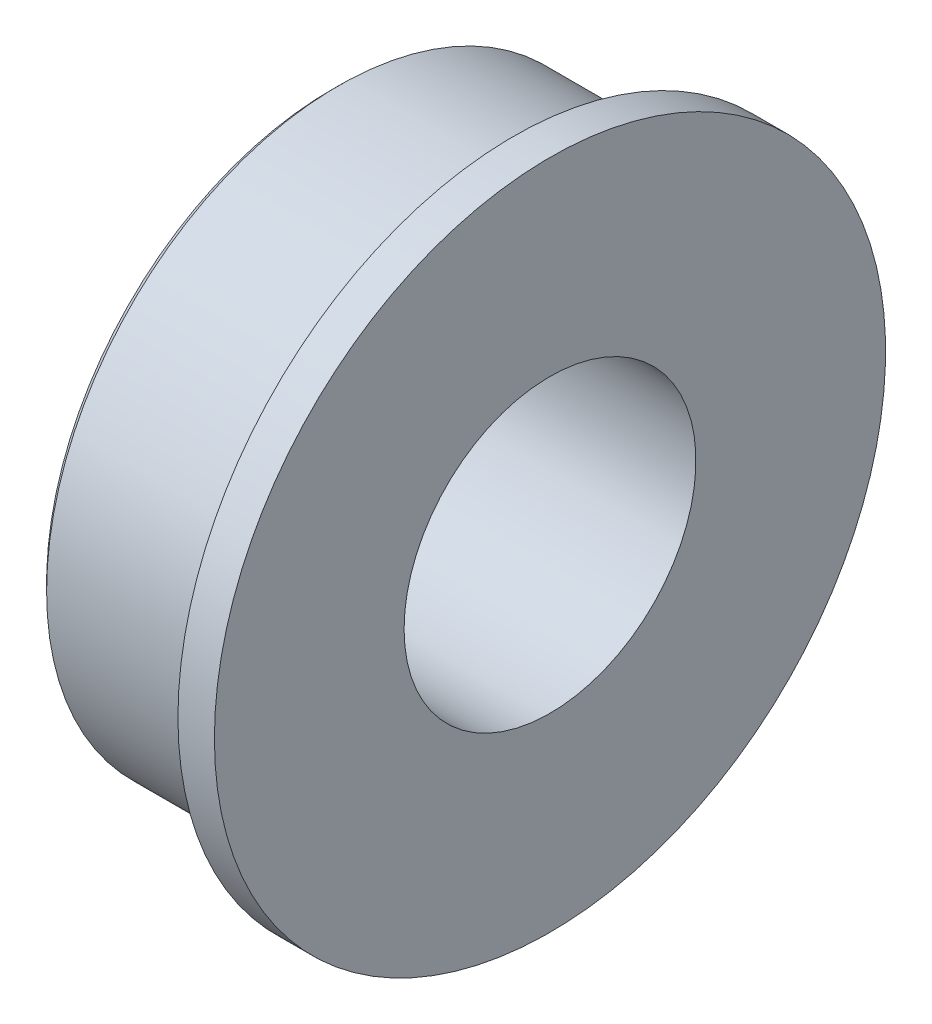
ISO-10303-21;
HEADER;
FILE_DESCRIPTION(('STEP AP214'),'2;1');
FILE_NAME('part.step','',(''),(''),'','','');
FILE_SCHEMA(('AUTOMOTIVE_DESIGN { 1 0 10303 214 1 1 1 1 }'));
ENDSEC;
DATA;
#1=APPLICATION_CONTEXT('core data for automotive mechanical design processes');
#2=APPLICATION_PROTOCOL_DEFINITION('international standard','automotive_design',2000,#1);
#3=PRODUCT_CONTEXT('',#1,'mechanical');
#4=PRODUCT('Part','Part','',(#3));
#5=PRODUCT_RELATED_PRODUCT_CATEGORY('part','',(#4));
#6=PRODUCT_DEFINITION_FORMATION('','',#4);
#7=PRODUCT_DEFINITION_CONTEXT('part definition',#1,'design');
#8=PRODUCT_DEFINITION('design','',#6,#7);
#9=PRODUCT_DEFINITION_SHAPE('','',#8);
#10=(LENGTH_UNIT() NAMED_UNIT(*) SI_UNIT(.MILLI.,.METRE.));
#11=(NAMED_UNIT(*) PLANE_ANGLE_UNIT() SI_UNIT($,.RADIAN.));
#12=(NAMED_UNIT(*) SI_UNIT($,.STERADIAN.) SOLID_ANGLE_UNIT());
#13=UNCERTAINTY_MEASURE_WITH_UNIT(LENGTH_MEASURE(1.E-05),#10,'distance_accuracy_value','');
#14=(GEOMETRIC_REPRESENTATION_CONTEXT(3) GLOBAL_UNCERTAINTY_ASSIGNED_CONTEXT((#13)) GLOBAL_UNIT_ASSIGNED_CONTEXT((#10,
#11,#12)) REPRESENTATION_CONTEXT('',''));
#15=CARTESIAN_POINT('',(0.,0.,0.));
#16=DIRECTION('',(0.,0.,1.));
#17=DIRECTION('',(1.,0.,0.));
#18=AXIS2_PLACEMENT_3D('',#15,#16,#17);
#19=CARTESIAN_POINT('',(0.,0.,0.));
#20=DIRECTION('',(-1.,0.,0.));
#21=DIRECTION('',(0.,0.,1.));
#22=AXIS2_PLACEMENT_3D('',#19,#20,#21);
#23=CYLINDRICAL_SURFACE('',#22,2.);
#24=CARTESIAN_POINT('',(3.,0.,0.));
#25=DIRECTION('',(-1.,0.,0.));
#26=DIRECTION('',(0.,0.,1.));
#27=AXIS2_PLACEMENT_3D('',#24,#25,#26);
#28=CIRCLE('',#27,2.);
#29=CARTESIAN_POINT('',(3.,0.,2.));
#30=VERTEX_POINT('',#29);
#31=EDGE_CURVE('E62',#30,#30,#28,.T.);
#32=ORIENTED_EDGE('',*,*,#31,.F.);
#33=EDGE_LOOP('',(#32));
#34=FACE_BOUND('',#33,.T.);
#35=CARTESIAN_POINT('',(0.,0.,0.));
#36=DIRECTION('',(-1.,0.,0.));
#37=DIRECTION('',(0.,0.,1.));
#38=AXIS2_PLACEMENT_3D('',#35,#36,#37);
#39=CIRCLE('',#38,2.);
#40=CARTESIAN_POINT('',(0.,0.,2.));
#41=VERTEX_POINT('',#40);
#42=EDGE_CURVE('E47',#41,#41,#39,.T.);
#43=ORIENTED_EDGE('',*,*,#42,.T.);
#44=EDGE_LOOP('',(#43));
#45=FACE_BOUND('',#44,.T.);
#46=ADVANCED_FACE('F35',(#34,#45),#23,.F.);
#47=CARTESIAN_POINT('',(0.,2.,0.));
#48=DIRECTION('',(1.,0.,0.));
#49=DIRECTION('',(0.,0.,-1.));
#50=AXIS2_PLACEMENT_3D('',#47,#48,#49);
#51=PLANE('',#50);
#52=CARTESIAN_POINT('',(0.,0.,0.));
#53=DIRECTION('',(1.,0.,0.));
#54=DIRECTION('',(0.,0.,-1.));
#55=AXIS2_PLACEMENT_3D('',#52,#53,#54);
#56=CIRCLE('',#55,3.9);
#57=CARTESIAN_POINT('',(0.,0.,-3.9));
#58=VERTEX_POINT('',#57);
#59=EDGE_CURVE('E43',#58,#58,#56,.F.);
#60=ORIENTED_EDGE('',*,*,#59,.T.);
#61=EDGE_LOOP('',(#60));
#62=FACE_BOUND('',#61,.T.);
#63=ORIENTED_EDGE('',*,*,#42,.F.);
#64=EDGE_LOOP('',(#63));
#65=FACE_BOUND('',#64,.T.);
#66=ADVANCED_FACE('F70',(#62,#65),#51,.F.);
#67=CARTESIAN_POINT('',(0.,0.,0.));
#68=DIRECTION('',(-1.,0.,0.));
#69=DIRECTION('',(0.,0.,1.));
#70=AXIS2_PLACEMENT_3D('',#67,#68,#69);
#71=CYLINDRICAL_SURFACE('',#70,4.);
#72=CARTESIAN_POINT('',(0.0999999999999977,0.,0.));
#73=DIRECTION('',(1.,0.,0.));
#74=DIRECTION('',(0.,0.,-1.));
#75=AXIS2_PLACEMENT_3D('',#72,#73,#74);
#76=CIRCLE('',#75,4.);
#77=CARTESIAN_POINT('',(0.0999999999999977,0.,-4.));
#78=VERTEX_POINT('',#77);
#79=EDGE_CURVE('E10',#78,#78,#76,.T.);
#80=ORIENTED_EDGE('',*,*,#79,.T.);
#81=EDGE_LOOP('',(#80));
#82=FACE_BOUND('',#81,.T.);
#83=CARTESIAN_POINT('',(2.5,0.,0.));
#84=DIRECTION('',(-1.,0.,0.));
#85=DIRECTION('',(0.,0.,1.));
#86=AXIS2_PLACEMENT_3D('',#83,#84,#85);
#87=CIRCLE('',#86,4.);
#88=CARTESIAN_POINT('',(2.5,0.,4.));
#89=VERTEX_POINT('',#88);
#90=EDGE_CURVE('E51',#89,#89,#87,.T.);
#91=ORIENTED_EDGE('',*,*,#90,.T.);
#92=EDGE_LOOP('',(#91));
#93=FACE_BOUND('',#92,.T.);
#94=ADVANCED_FACE('F74',(#82,#93),#71,.T.);
#95=CARTESIAN_POINT('',(2.5,4.,0.));
#96=DIRECTION('',(1.,0.,0.));
#97=DIRECTION('',(0.,0.,-1.));
#98=AXIS2_PLACEMENT_3D('',#95,#96,#97);
#99=PLANE('',#98);
#100=ORIENTED_EDGE('',*,*,#90,.F.);
#101=EDGE_LOOP('',(#100));
#102=FACE_BOUND('',#101,.T.);
#103=CARTESIAN_POINT('',(2.5,0.,0.));
#104=DIRECTION('',(-1.,0.,0.));
#105=DIRECTION('',(0.,0.,1.));
#106=AXIS2_PLACEMENT_3D('',#103,#104,#105);
#107=CIRCLE('',#106,4.6);
#108=CARTESIAN_POINT('',(2.5,0.,4.6));
#109=VERTEX_POINT('',#108);
#110=EDGE_CURVE('E56',#109,#109,#107,.T.);
#111=ORIENTED_EDGE('',*,*,#110,.T.);
#112=EDGE_LOOP('',(#111));
#113=FACE_BOUND('',#112,.T.);
#114=ADVANCED_FACE('F79',(#102,#113),#99,.F.);
#115=CARTESIAN_POINT('',(0.,0.,0.));
#116=DIRECTION('',(-1.,0.,0.));
#117=DIRECTION('',(0.,0.,1.));
#118=AXIS2_PLACEMENT_3D('',#115,#116,#117);
#119=CYLINDRICAL_SURFACE('',#118,4.6);
#120=ORIENTED_EDGE('',*,*,#110,.F.);
#121=EDGE_LOOP('',(#120));
#122=FACE_BOUND('',#121,.T.);
#123=CARTESIAN_POINT('',(3.,0.,0.));
#124=DIRECTION('',(-1.,0.,0.));
#125=DIRECTION('',(0.,0.,1.));
#126=AXIS2_PLACEMENT_3D('',#123,#124,#125);
#127=CIRCLE('',#126,4.6);
#128=CARTESIAN_POINT('',(3.,0.,4.6));
#129=VERTEX_POINT('',#128);
#130=EDGE_CURVE('E59',#129,#129,#127,.T.);
#131=ORIENTED_EDGE('',*,*,#130,.T.);
#132=EDGE_LOOP('',(#131));
#133=FACE_BOUND('',#132,.T.);
#134=ADVANCED_FACE('F84',(#122,#133),#119,.T.);
#135=CARTESIAN_POINT('',(3.,4.6,0.));
#136=DIRECTION('',(-1.,0.,0.));
#137=DIRECTION('',(0.,0.,1.));
#138=AXIS2_PLACEMENT_3D('',#135,#136,#137);
#139=PLANE('',#138);
#140=ORIENTED_EDGE('',*,*,#130,.F.);
#141=EDGE_LOOP('',(#140));
#142=FACE_BOUND('',#141,.T.);
#143=ORIENTED_EDGE('',*,*,#31,.T.);
#144=EDGE_LOOP('',(#143));
#145=FACE_BOUND('',#144,.T.);
#146=ADVANCED_FACE('F66',(#142,#145),#139,.F.);
#147=CARTESIAN_POINT('',(0.,0.,0.));
#148=DIRECTION('',(1.,0.,0.));
#149=DIRECTION('',(0.,0.,-1.));
#150=AXIS2_PLACEMENT_3D('',#147,#148,#149);
#151=CONICAL_SURFACE('',#150,3.9,0.785398163397448);
#152=ORIENTED_EDGE('',*,*,#79,.F.);
#153=EDGE_LOOP('',(#152));
#154=FACE_BOUND('',#153,.T.);
#155=ORIENTED_EDGE('',*,*,#59,.F.);
#156=EDGE_LOOP('',(#155));
#157=FACE_BOUND('',#156,.T.);
#158=ADVANCED_FACE('F38',(#154,#157),#151,.T.);
#159=CLOSED_SHELL('',(#46,#66,#94,#114,#134,#146,#158));
#160=MANIFOLD_SOLID_BREP('B2',#159);
#161=ADVANCED_BREP_SHAPE_REPRESENTATION('',(#18,#160),#14);
#162=SHAPE_DEFINITION_REPRESENTATION(#9,#161);
ENDSEC;
END-ISO-10303-21;
